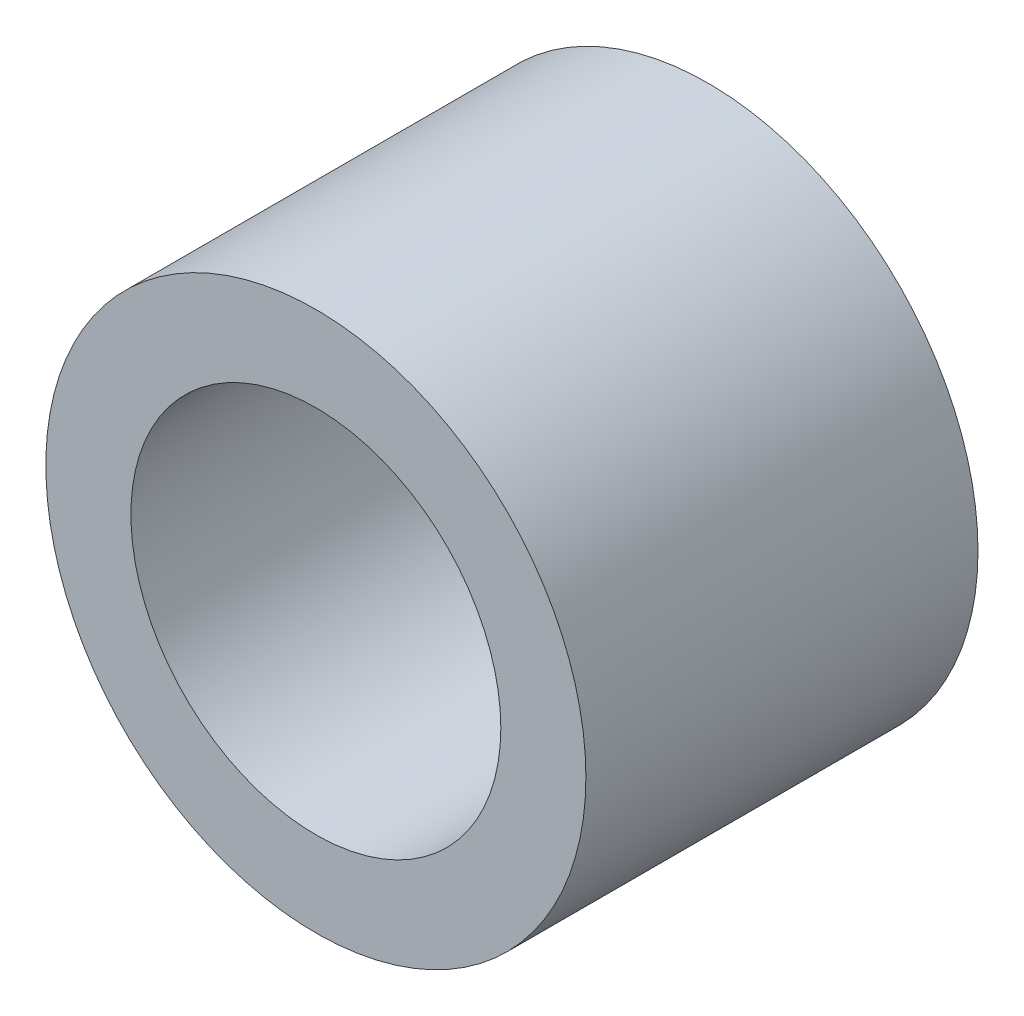
ISO-10303-21;
HEADER;
FILE_DESCRIPTION(('STEP AP214'),'2;1');
FILE_NAME('part.step','',(''),(''),'','','');
FILE_SCHEMA(('AUTOMOTIVE_DESIGN { 1 0 10303 214 1 1 1 1 }'));
ENDSEC;
DATA;
#1=APPLICATION_CONTEXT('core data for automotive mechanical design processes');
#2=APPLICATION_PROTOCOL_DEFINITION('international standard','automotive_design',2000,#1);
#3=PRODUCT_CONTEXT('',#1,'mechanical');
#4=PRODUCT('Part','Part','',(#3));
#5=PRODUCT_RELATED_PRODUCT_CATEGORY('part','',(#4));
#6=PRODUCT_DEFINITION_FORMATION('','',#4);
#7=PRODUCT_DEFINITION_CONTEXT('part definition',#1,'design');
#8=PRODUCT_DEFINITION('design','',#6,#7);
#9=PRODUCT_DEFINITION_SHAPE('','',#8);
#10=(LENGTH_UNIT() NAMED_UNIT(*) SI_UNIT(.MILLI.,.METRE.));
#11=(NAMED_UNIT(*) PLANE_ANGLE_UNIT() SI_UNIT($,.RADIAN.));
#12=(NAMED_UNIT(*) SI_UNIT($,.STERADIAN.) SOLID_ANGLE_UNIT());
#13=UNCERTAINTY_MEASURE_WITH_UNIT(LENGTH_MEASURE(1.E-05),#10,'distance_accuracy_value','');
#14=(GEOMETRIC_REPRESENTATION_CONTEXT(3) GLOBAL_UNCERTAINTY_ASSIGNED_CONTEXT((#13)) GLOBAL_UNIT_ASSIGNED_CONTEXT((#10,
#11,#12)) REPRESENTATION_CONTEXT('',''));
#15=CARTESIAN_POINT('',(0.,0.,0.));
#16=DIRECTION('',(0.,0.,1.));
#17=DIRECTION('',(1.,0.,0.));
#18=AXIS2_PLACEMENT_3D('',#15,#16,#17);
#19=CARTESIAN_POINT('',(0.,0.,5.3));
#20=DIRECTION('',(0.,0.,1.));
#21=DIRECTION('',(1.,0.,0.));
#22=AXIS2_PLACEMENT_3D('',#19,#20,#21);
#23=PLANE('',#22);
#24=CARTESIAN_POINT('',(0.,0.,5.3));
#25=DIRECTION('',(0.,0.,1.));
#26=DIRECTION('',(1.,0.,0.));
#27=AXIS2_PLACEMENT_3D('',#24,#25,#26);
#28=CIRCLE('',#27,3.65);
#29=CARTESIAN_POINT('',(3.65,0.,5.3));
#30=VERTEX_POINT('',#29);
#31=EDGE_CURVE('E10',#30,#30,#28,.T.);
#32=ORIENTED_EDGE('',*,*,#31,.T.);
#33=EDGE_LOOP('',(#32));
#34=FACE_BOUND('',#33,.T.);
#35=CARTESIAN_POINT('',(0.,0.,5.3));
#36=DIRECTION('',(0.,0.,1.));
#37=DIRECTION('',(1.,0.,0.));
#38=AXIS2_PLACEMENT_3D('',#35,#36,#37);
#39=CIRCLE('',#38,2.5);
#40=CARTESIAN_POINT('',(2.5,0.,5.3));
#41=VERTEX_POINT('',#40);
#42=EDGE_CURVE('E42',#41,#41,#39,.T.);
#43=ORIENTED_EDGE('',*,*,#42,.F.);
#44=EDGE_LOOP('',(#43));
#45=FACE_BOUND('',#44,.T.);
#46=ADVANCED_FACE('F31',(#34,#45),#23,.T.);
#47=CARTESIAN_POINT('',(0.,0.,0.));
#48=DIRECTION('',(0.,0.,1.));
#49=DIRECTION('',(1.,0.,0.));
#50=AXIS2_PLACEMENT_3D('',#47,#48,#49);
#51=PLANE('',#50);
#52=CARTESIAN_POINT('',(0.,0.,0.));
#53=DIRECTION('',(0.,0.,1.));
#54=DIRECTION('',(1.,0.,0.));
#55=AXIS2_PLACEMENT_3D('',#52,#53,#54);
#56=CIRCLE('',#55,3.65);
#57=CARTESIAN_POINT('',(3.65,0.,0.));
#58=VERTEX_POINT('',#57);
#59=EDGE_CURVE('E35',#58,#58,#56,.T.);
#60=ORIENTED_EDGE('',*,*,#59,.F.);
#61=EDGE_LOOP('',(#60));
#62=FACE_BOUND('',#61,.T.);
#63=CARTESIAN_POINT('',(0.,0.,0.));
#64=DIRECTION('',(0.,0.,1.));
#65=DIRECTION('',(1.,0.,0.));
#66=AXIS2_PLACEMENT_3D('',#63,#64,#65);
#67=CIRCLE('',#66,2.5);
#68=CARTESIAN_POINT('',(2.5,0.,0.));
#69=VERTEX_POINT('',#68);
#70=EDGE_CURVE('E44',#69,#69,#67,.T.);
#71=ORIENTED_EDGE('',*,*,#70,.T.);
#72=EDGE_LOOP('',(#71));
#73=FACE_BOUND('',#72,.T.);
#74=ADVANCED_FACE('F54',(#62,#73),#51,.F.);
#75=CARTESIAN_POINT('',(0.,0.,5.3));
#76=DIRECTION('',(0.,0.,-1.));
#77=DIRECTION('',(-1.,0.,0.));
#78=AXIS2_PLACEMENT_3D('',#75,#76,#77);
#79=CYLINDRICAL_SURFACE('',#78,3.65);
#80=ORIENTED_EDGE('',*,*,#31,.F.);
#81=EDGE_LOOP('',(#80));
#82=FACE_BOUND('',#81,.T.);
#83=ORIENTED_EDGE('',*,*,#59,.T.);
#84=EDGE_LOOP('',(#83));
#85=FACE_BOUND('',#84,.T.);
#86=ADVANCED_FACE('F33',(#82,#85),#79,.T.);
#87=CARTESIAN_POINT('',(0.,0.,5.3));
#88=DIRECTION('',(0.,0.,-1.));
#89=DIRECTION('',(-1.,0.,0.));
#90=AXIS2_PLACEMENT_3D('',#87,#88,#89);
#91=CYLINDRICAL_SURFACE('',#90,2.5);
#92=ORIENTED_EDGE('',*,*,#42,.T.);
#93=EDGE_LOOP('',(#92));
#94=FACE_BOUND('',#93,.T.);
#95=ORIENTED_EDGE('',*,*,#70,.F.);
#96=EDGE_LOOP('',(#95));
#97=FACE_BOUND('',#96,.T.);
#98=ADVANCED_FACE('F50',(#94,#97),#91,.F.);
#99=CLOSED_SHELL('',(#46,#74,#86,#98));
#100=MANIFOLD_SOLID_BREP('B2',#99);
#101=ADVANCED_BREP_SHAPE_REPRESENTATION('',(#18,#100),#14);
#102=SHAPE_DEFINITION_REPRESENTATION(#9,#101);
ENDSEC;
END-ISO-10303-21;
